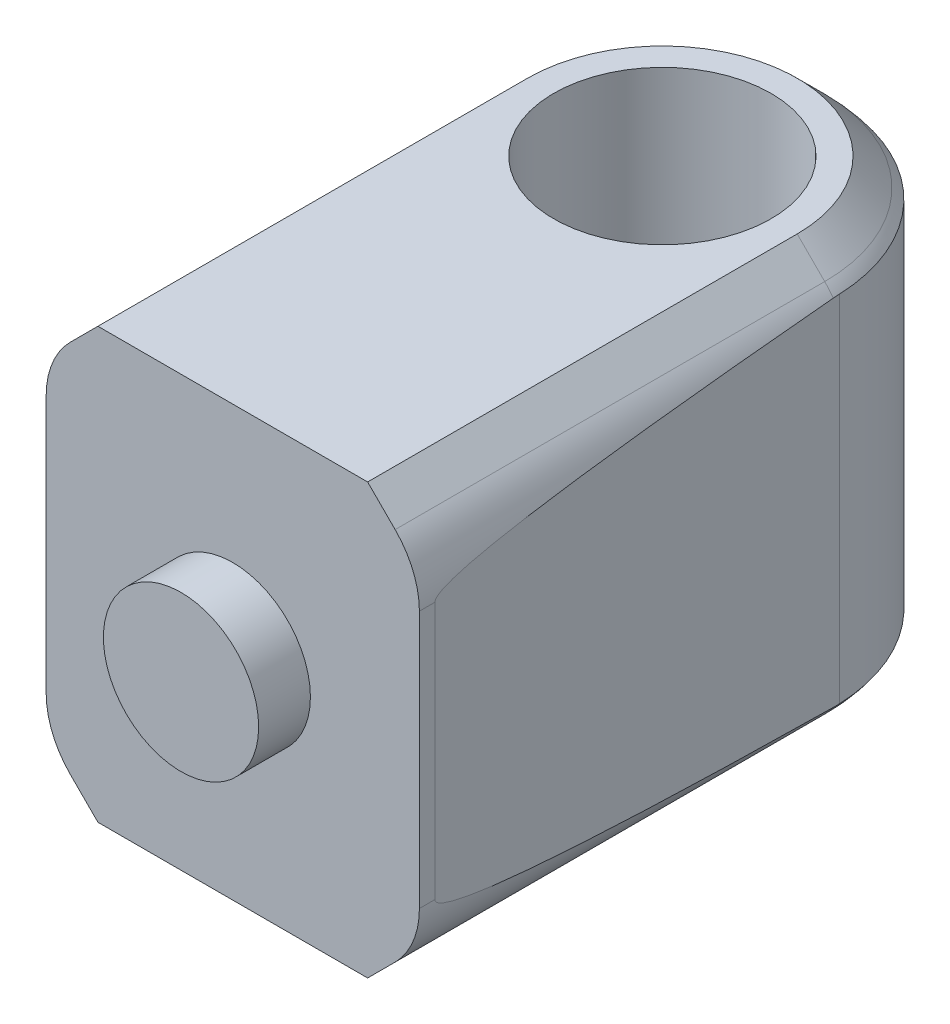
ISO-10303-21;
HEADER;
FILE_DESCRIPTION(('STEP AP214'),'2;1');
FILE_NAME('part.step','',(''),(''),'','','');
FILE_SCHEMA(('AUTOMOTIVE_DESIGN { 1 0 10303 214 1 1 1 1 }'));
ENDSEC;
DATA;
#1=APPLICATION_CONTEXT('core data for automotive mechanical design processes');
#2=APPLICATION_PROTOCOL_DEFINITION('international standard','automotive_design',2000,#1);
#3=PRODUCT_CONTEXT('',#1,'mechanical');
#4=PRODUCT('Part','Part','',(#3));
#5=PRODUCT_RELATED_PRODUCT_CATEGORY('part','',(#4));
#6=PRODUCT_DEFINITION_FORMATION('','',#4);
#7=PRODUCT_DEFINITION_CONTEXT('part definition',#1,'design');
#8=PRODUCT_DEFINITION('design','',#6,#7);
#9=PRODUCT_DEFINITION_SHAPE('','',#8);
#10=(LENGTH_UNIT() NAMED_UNIT(*) SI_UNIT(.MILLI.,.METRE.));
#11=(NAMED_UNIT(*) PLANE_ANGLE_UNIT() SI_UNIT($,.RADIAN.));
#12=(NAMED_UNIT(*) SI_UNIT($,.STERADIAN.) SOLID_ANGLE_UNIT());
#13=UNCERTAINTY_MEASURE_WITH_UNIT(LENGTH_MEASURE(1.E-05),#10,'distance_accuracy_value','');
#14=(GEOMETRIC_REPRESENTATION_CONTEXT(3) GLOBAL_UNCERTAINTY_ASSIGNED_CONTEXT((#13)) GLOBAL_UNIT_ASSIGNED_CONTEXT((#10,
#11,#12)) REPRESENTATION_CONTEXT('',''));
#15=CARTESIAN_POINT('',(0.,0.,0.));
#16=DIRECTION('',(0.,0.,1.));
#17=DIRECTION('',(1.,0.,0.));
#18=AXIS2_PLACEMENT_3D('',#15,#16,#17);
#19=CARTESIAN_POINT('',(0.,-15.6,34.));
#20=DIRECTION('',(0.,0.,1.));
#21=DIRECTION('',(1.,0.,0.));
#22=AXIS2_PLACEMENT_3D('',#19,#20,#21);
#23=PLANE('',#22);
#24=CARTESIAN_POINT('',(0.,-15.6,34.));
#25=DIRECTION('',(0.,0.,1.));
#26=DIRECTION('',(1.,0.,0.));
#27=AXIS2_PLACEMENT_3D('',#24,#25,#26);
#28=CIRCLE('',#27,7.5);
#29=CARTESIAN_POINT('',(7.5,-15.6,34.));
#30=VERTEX_POINT('',#29);
#31=EDGE_CURVE('E136',#30,#30,#28,.F.);
#32=ORIENTED_EDGE('',*,*,#31,.F.);
#33=EDGE_LOOP('',(#32));
#34=FACE_BOUND('',#33,.T.);
#35=ADVANCED_FACE('F16',(#34),#23,.T.);
#36=CARTESIAN_POINT('',(-18.0275,-36.35,27.5));
#37=DIRECTION('',(0.999282889986121,0.,0.0378643074806198));
#38=DIRECTION('',(0.0378643074806198,0.,-0.999282889986121));
#39=AXIS2_PLACEMENT_3D('',#36,#37,#38);
#40=PLANE('',#39);
#41=CARTESIAN_POINT('',(-16.488167684771,1.5380724136057,-13.1247610734302));
#42=CARTESIAN_POINT('',(-16.4921159039639,1.53807523926735,-13.0205630001558));
#43=CARTESIAN_POINT('',(-16.4960627736952,1.53671469873845,-12.9164005407328));
#44=CARTESIAN_POINT('',(-16.5039538142348,1.53126688529956,-12.7081468495894));
#45=CARTESIAN_POINT('',(-16.5078979850431,1.52717961238957,-12.604055617869));
#46=CARTESIAN_POINT('',(-16.5118408063899,1.52172897328904,-12.5));
#47=B_SPLINE_CURVE_WITH_KNOTS('',3,(#41,#42,#43,#44,#45,#46),.UNSPECIFIED.,.F.,.F.,(4,2,4),(0.,
0.312738263150495,0.62547652630099),.UNSPECIFIED.);
#48=CARTESIAN_POINT('',(-16.488167684771,1.5380724136057,-13.1247610734302));
#49=VERTEX_POINT('',#48);
#50=CARTESIAN_POINT('',(-16.5118408063898,1.52172897328904,-12.5));
#51=VERTEX_POINT('',#50);
#52=EDGE_CURVE('E19',#49,#51,#47,.T.);
#53=ORIENTED_EDGE('',*,*,#52,.F.);
#54=DIRECTION('',(0.,1.,0.));
#55=VECTOR('',#54,1.);
#56=CARTESIAN_POINT('',(-16.488167684771,-36.35,-13.1247610734302));
#57=LINE('',#56,#55);
#58=CARTESIAN_POINT('',(-16.488167684771,-32.7380724136057,-13.1247610734302));
#59=VERTEX_POINT('',#58);
#60=EDGE_CURVE('E127',#59,#49,#57,.T.);
#61=ORIENTED_EDGE('',*,*,#60,.F.);
#62=CARTESIAN_POINT('',(-16.5118408063899,-32.721728973289,-12.5));
#63=CARTESIAN_POINT('',(-16.5078979850431,-32.7271796123895,-12.604055617869));
#64=CARTESIAN_POINT('',(-16.5039538142348,-32.7312668852995,-12.7081468495894));
#65=CARTESIAN_POINT('',(-16.4960627736952,-32.7367146987384,-12.9164005407328));
#66=CARTESIAN_POINT('',(-16.4921159039639,-32.7380752392673,-13.0205630001558));
#67=CARTESIAN_POINT('',(-16.488167684771,-32.7380724136057,-13.1247610734302));
#68=B_SPLINE_CURVE_WITH_KNOTS('',3,(#62,#63,#64,#65,#66,#67),.UNSPECIFIED.,.F.,.F.,(4,2,4),(0.,
0.312738263150497,0.625476526300994),.UNSPECIFIED.);
#69=CARTESIAN_POINT('',(-16.5118408063898,-32.721728973289,-12.5));
#70=VERTEX_POINT('',#69);
#71=EDGE_CURVE('E211',#70,#59,#68,.T.);
#72=ORIENTED_EDGE('',*,*,#71,.F.);
#73=CARTESIAN_POINT('',(-10.0275,-28.0362915010152,-183.629257387863));
#74=DIRECTION('',(0.999282889986121,0.,0.0378643074806198));
#75=DIRECTION('',(0.0378643074806198,0.,-0.999282889986121));
#76=AXIS2_PLACEMENT_3D('',#73,#74,#75);
#77=ELLIPSE('',#76,211.280768943012,8.);
#78=CARTESIAN_POINT('',(-18.0275,-28.0362915010152,27.5));
#79=VERTEX_POINT('',#78);
#80=EDGE_CURVE('E165',#79,#70,#77,.T.);
#81=ORIENTED_EDGE('',*,*,#80,.F.);
#82=DIRECTION('',(0.,-1.,0.));
#83=VECTOR('',#82,1.);
#84=CARTESIAN_POINT('',(-18.0275,-3.16370849898476,27.5));
#85=LINE('',#84,#83);
#86=CARTESIAN_POINT('',(-18.0275,-3.16370849898476,27.5));
#87=VERTEX_POINT('',#86);
#88=EDGE_CURVE('E132',#87,#79,#85,.T.);
#89=ORIENTED_EDGE('',*,*,#88,.F.);
#90=CARTESIAN_POINT('',(-10.0275,-3.16370849898476,-183.629257387863));
#91=DIRECTION('',(0.999282889986121,0.,0.0378643074806198));
#92=DIRECTION('',(-0.0378643074806198,0.,0.999282889986121));
#93=AXIS2_PLACEMENT_3D('',#90,#91,#92);
#94=ELLIPSE('',#93,211.280768943012,8.);
#95=EDGE_CURVE('E129',#51,#87,#94,.T.);
#96=ORIENTED_EDGE('',*,*,#95,.F.);
#97=EDGE_LOOP('',(#53,#61,#72,#81,#89,#96));
#98=FACE_BOUND('',#97,.T.);
#99=ADVANCED_FACE('F130',(#98),#40,.F.);
#100=CARTESIAN_POINT('',(0.,-36.35,-12.5));
#101=DIRECTION('',(0.,1.,0.));
#102=DIRECTION('',(0.,0.,1.));
#103=AXIS2_PLACEMENT_3D('',#100,#101,#102);
#104=CYLINDRICAL_SURFACE('',#103,16.5);
#105=CARTESIAN_POINT('',(0.,-32.7380724136057,-12.5));
#106=DIRECTION('',(0.,-1.,0.));
#107=DIRECTION('',(0.,0.,-1.));
#108=AXIS2_PLACEMENT_3D('',#105,#106,#107);
#109=CIRCLE('',#108,16.5);
#110=CARTESIAN_POINT('',(16.488167684771,-32.7380724136057,-13.1247610734302));
#111=VERTEX_POINT('',#110);
#112=EDGE_CURVE('E190',#59,#111,#109,.T.);
#113=ORIENTED_EDGE('',*,*,#112,.F.);
#114=ORIENTED_EDGE('',*,*,#60,.T.);
#115=CARTESIAN_POINT('',(0.,1.5380724136057,-12.5));
#116=DIRECTION('',(0.,1.,0.));
#117=DIRECTION('',(0.,0.,1.));
#118=AXIS2_PLACEMENT_3D('',#115,#116,#117);
#119=CIRCLE('',#118,16.5);
#120=CARTESIAN_POINT('',(16.488167684771,1.53807241360571,-13.1247610734302));
#121=VERTEX_POINT('',#120);
#122=EDGE_CURVE('E126',#121,#49,#119,.T.);
#123=ORIENTED_EDGE('',*,*,#122,.F.);
#124=DIRECTION('',(0.,1.,0.));
#125=VECTOR('',#124,1.);
#126=CARTESIAN_POINT('',(16.488167684771,-36.35,-13.1247610734302));
#127=LINE('',#126,#125);
#128=EDGE_CURVE('E215',#121,#111,#127,.F.);
#129=ORIENTED_EDGE('',*,*,#128,.T.);
#130=EDGE_LOOP('',(#113,#114,#123,#129));
#131=FACE_BOUND('',#130,.T.);
#132=ADVANCED_FACE('F218',(#131),#104,.T.);
#133=CARTESIAN_POINT('',(16.488167684771,-36.35,-13.1247610734302));
#134=DIRECTION('',(-0.999282889986121,0.,0.0378643074806198));
#135=DIRECTION('',(0.0378643074806198,0.,0.999282889986121));
#136=AXIS2_PLACEMENT_3D('',#133,#134,#135);
#137=PLANE('',#136);
#138=CARTESIAN_POINT('',(10.0275,-3.16370849898476,-183.629257387863));
#139=DIRECTION('',(-0.999282889986121,0.,0.0378643074806198));
#140=DIRECTION('',(-0.0378643074806198,0.,-0.999282889986121));
#141=AXIS2_PLACEMENT_3D('',#138,#139,#140);
#142=ELLIPSE('',#141,211.280768943012,8.);
#143=CARTESIAN_POINT('',(18.0275,-3.16370849898476,27.4999999999998));
#144=VERTEX_POINT('',#143);
#145=CARTESIAN_POINT('',(16.5118408063898,1.52172897328904,-12.5));
#146=VERTEX_POINT('',#145);
#147=EDGE_CURVE('E292',#144,#146,#142,.T.);
#148=ORIENTED_EDGE('',*,*,#147,.F.);
#149=DIRECTION('',(0.,1.,0.));
#150=VECTOR('',#149,1.);
#151=CARTESIAN_POINT('',(18.0275,-28.0362915010152,27.5));
#152=LINE('',#151,#150);
#153=CARTESIAN_POINT('',(18.0275,-28.0362915010152,27.4999999999998));
#154=VERTEX_POINT('',#153);
#155=EDGE_CURVE('E171',#154,#144,#152,.T.);
#156=ORIENTED_EDGE('',*,*,#155,.F.);
#157=CARTESIAN_POINT('',(10.0275,-28.0362915010152,-183.629257387863));
#158=DIRECTION('',(-0.999282889986121,0.,0.0378643074806198));
#159=DIRECTION('',(0.0378643074806198,0.,0.999282889986121));
#160=AXIS2_PLACEMENT_3D('',#157,#158,#159);
#161=ELLIPSE('',#160,211.280768943012,8.);
#162=CARTESIAN_POINT('',(16.5118408063899,-32.721728973289,-12.5));
#163=VERTEX_POINT('',#162);
#164=EDGE_CURVE('E175',#163,#154,#161,.T.);
#165=ORIENTED_EDGE('',*,*,#164,.F.);
#166=CARTESIAN_POINT('',(16.488167684771,-32.7380724136057,-13.1247610734302));
#167=CARTESIAN_POINT('',(16.4921159039639,-32.7380752392673,-13.0205630001558));
#168=CARTESIAN_POINT('',(16.4960627736952,-32.7367146987384,-12.9164005407328));
#169=CARTESIAN_POINT('',(16.5039538142348,-32.7312668852995,-12.7081468495894));
#170=CARTESIAN_POINT('',(16.5078979850431,-32.7271796123895,-12.604055617869));
#171=CARTESIAN_POINT('',(16.5118408063899,-32.721728973289,-12.5));
#172=B_SPLINE_CURVE_WITH_KNOTS('',3,(#166,#167,#168,#169,#170,#171),.UNSPECIFIED.,.F.,.F.,(4,2,
4),(0.,0.312738263150492,0.625476526300984),.UNSPECIFIED.);
#173=EDGE_CURVE('E206',#111,#163,#172,.T.);
#174=ORIENTED_EDGE('',*,*,#173,.F.);
#175=ORIENTED_EDGE('',*,*,#128,.F.);
#176=CARTESIAN_POINT('',(16.5118408063899,1.52172897328903,-12.5));
#177=CARTESIAN_POINT('',(16.5078979850431,1.52717961238956,-12.604055617869));
#178=CARTESIAN_POINT('',(16.5039538142348,1.53126688529954,-12.7081468495894));
#179=CARTESIAN_POINT('',(16.4960627736952,1.53671469873843,-12.9164005407328));
#180=CARTESIAN_POINT('',(16.4921159039639,1.53807523926733,-13.0205630001558));
#181=CARTESIAN_POINT('',(16.488167684771,1.53807241360569,-13.1247610734302));
#182=B_SPLINE_CURVE_WITH_KNOTS('',3,(#176,#177,#178,#179,#180,#181),.UNSPECIFIED.,.F.,.F.,(4,2,
4),(0.,0.312738263150491,0.625476526300983),.UNSPECIFIED.);
#183=EDGE_CURVE('E143',#146,#121,#182,.T.);
#184=ORIENTED_EDGE('',*,*,#183,.F.);
#185=EDGE_LOOP('',(#148,#156,#165,#174,#175,#184));
#186=FACE_BOUND('',#185,.T.);
#187=ADVANCED_FACE('F199',(#186),#137,.F.);
#188=CARTESIAN_POINT('',(0.,-28.0362915010152,-12.5));
#189=DIRECTION('',(0.,-1.,0.));
#190=DIRECTION('',(0.,0.,-1.));
#191=AXIS2_PLACEMENT_3D('',#188,#189,#190);
#192=TOROIDAL_SURFACE('',#191,10.0275,8.);
#193=CARTESIAN_POINT('',(0.,-33.6931457505076,-12.5));
#194=DIRECTION('',(0.,1.,0.));
#195=DIRECTION('',(-1.,0.,0.));
#196=AXIS2_PLACEMENT_3D('',#193,#194,#195);
#197=CIRCLE('',#196,15.6843542494924);
#198=CARTESIAN_POINT('',(-15.6843542494924,-33.6931457505076,-12.5));
#199=VERTEX_POINT('',#198);
#200=CARTESIAN_POINT('',(15.6843542494924,-33.6931457505076,-12.5));
#201=VERTEX_POINT('',#200);
#202=EDGE_CURVE('E156',#199,#201,#197,.F.);
#203=ORIENTED_EDGE('',*,*,#202,.F.);
#204=CARTESIAN_POINT('',(-10.0275,-28.0362915010152,-12.5));
#205=DIRECTION('',(0.,0.,-1.));
#206=DIRECTION('',(-1.,0.,0.));
#207=AXIS2_PLACEMENT_3D('',#204,#205,#206);
#208=CIRCLE('',#207,8.);
#209=EDGE_CURVE('E162',#70,#199,#208,.F.);
#210=ORIENTED_EDGE('',*,*,#209,.F.);
#211=ORIENTED_EDGE('',*,*,#71,.T.);
#212=ORIENTED_EDGE('',*,*,#112,.T.);
#213=ORIENTED_EDGE('',*,*,#173,.T.);
#214=CARTESIAN_POINT('',(10.0275,-28.0362915010152,-12.5));
#215=DIRECTION('',(0.,0.,1.));
#216=DIRECTION('',(1.,0.,0.));
#217=AXIS2_PLACEMENT_3D('',#214,#215,#216);
#218=CIRCLE('',#217,8.);
#219=EDGE_CURVE('E172',#201,#163,#218,.T.);
#220=ORIENTED_EDGE('',*,*,#219,.F.);
#221=EDGE_LOOP('',(#203,#210,#211,#212,#213,#220));
#222=FACE_BOUND('',#221,.T.);
#223=ADVANCED_FACE('F193',(#222),#192,.T.);
#224=CARTESIAN_POINT('',(10.0275,-28.0362915010152,20.25));
#225=DIRECTION('',(0.,0.,1.));
#226=DIRECTION('',(1.,0.,0.));
#227=AXIS2_PLACEMENT_3D('',#224,#225,#226);
#228=CYLINDRICAL_SURFACE('',#227,8.);
#229=DIRECTION('',(0.,0.,1.));
#230=VECTOR('',#229,1.);
#231=CARTESIAN_POINT('',(15.6843542494924,-33.6931457505076,13.));
#232=LINE('',#231,#230);
#233=CARTESIAN_POINT('',(15.6843542494924,-33.6931457505076,29.));
#234=VERTEX_POINT('',#233);
#235=EDGE_CURVE('E178',#201,#234,#232,.T.);
#236=ORIENTED_EDGE('',*,*,#235,.F.);
#237=ORIENTED_EDGE('',*,*,#219,.T.);
#238=ORIENTED_EDGE('',*,*,#164,.T.);
#239=DIRECTION('',(0.,0.,-1.));
#240=VECTOR('',#239,1.);
#241=CARTESIAN_POINT('',(18.0275,-28.0362915010152,27.5));
#242=LINE('',#241,#240);
#243=CARTESIAN_POINT('',(18.0275,-28.0362915010152,29.));
#244=VERTEX_POINT('',#243);
#245=EDGE_CURVE('E168',#244,#154,#242,.T.);
#246=ORIENTED_EDGE('',*,*,#245,.F.);
#247=CARTESIAN_POINT('',(10.0275,-28.0362915010152,29.));
#248=DIRECTION('',(0.,0.,1.));
#249=DIRECTION('',(1.,0.,0.));
#250=AXIS2_PLACEMENT_3D('',#247,#248,#249);
#251=CIRCLE('',#250,8.);
#252=EDGE_CURVE('E323',#234,#244,#251,.T.);
#253=ORIENTED_EDGE('',*,*,#252,.F.);
#254=EDGE_LOOP('',(#236,#237,#238,#246,#253));
#255=FACE_BOUND('',#254,.T.);
#256=ADVANCED_FACE('F198',(#255),#228,.T.);
#257=CARTESIAN_POINT('',(18.0275,-28.0362915010152,27.5));
#258=DIRECTION('',(1.,0.,0.));
#259=DIRECTION('',(0.,0.,-1.));
#260=AXIS2_PLACEMENT_3D('',#257,#258,#259);
#261=PLANE('',#260);
#262=DIRECTION('',(0.,1.,0.));
#263=VECTOR('',#262,1.);
#264=CARTESIAN_POINT('',(18.0275,-15.6,29.));
#265=LINE('',#264,#263);
#266=CARTESIAN_POINT('',(18.0275,-3.16370849898476,29.));
#267=VERTEX_POINT('',#266);
#268=EDGE_CURVE('E324',#244,#267,#265,.T.);
#269=ORIENTED_EDGE('',*,*,#268,.F.);
#270=ORIENTED_EDGE('',*,*,#245,.T.);
#271=ORIENTED_EDGE('',*,*,#155,.T.);
#272=DIRECTION('',(0.,0.,-1.));
#273=VECTOR('',#272,1.);
#274=CARTESIAN_POINT('',(18.0275,-3.16370849898476,20.25));
#275=LINE('',#274,#273);
#276=EDGE_CURVE('E185',#267,#144,#275,.T.);
#277=ORIENTED_EDGE('',*,*,#276,.F.);
#278=EDGE_LOOP('',(#269,#270,#271,#277));
#279=FACE_BOUND('',#278,.T.);
#280=ADVANCED_FACE('F437',(#279),#261,.T.);
#281=CARTESIAN_POINT('',(-18.0275,-3.16370849898476,27.5));
#282=DIRECTION('',(-1.,0.,0.));
#283=DIRECTION('',(0.,-1.,0.));
#284=AXIS2_PLACEMENT_3D('',#281,#282,#283);
#285=PLANE('',#284);
#286=DIRECTION('',(0.,1.,0.));
#287=VECTOR('',#286,1.);
#288=CARTESIAN_POINT('',(-18.0275,-15.6,29.));
#289=LINE('',#288,#287);
#290=CARTESIAN_POINT('',(-18.0275,-3.16370849898476,29.));
#291=VERTEX_POINT('',#290);
#292=CARTESIAN_POINT('',(-18.0275,-28.0362915010152,29.));
#293=VERTEX_POINT('',#292);
#294=EDGE_CURVE('E327',#291,#293,#289,.F.);
#295=ORIENTED_EDGE('',*,*,#294,.F.);
#296=DIRECTION('',(0.,0.,1.));
#297=VECTOR('',#296,1.);
#298=CARTESIAN_POINT('',(-18.0275,-3.16370849898476,20.25));
#299=LINE('',#298,#297);
#300=EDGE_CURVE('E135',#87,#291,#299,.T.);
#301=ORIENTED_EDGE('',*,*,#300,.F.);
#302=ORIENTED_EDGE('',*,*,#88,.T.);
#303=DIRECTION('',(0.,0.,-1.));
#304=VECTOR('',#303,1.);
#305=CARTESIAN_POINT('',(-18.0275,-28.0362915010152,20.25));
#306=LINE('',#305,#304);
#307=EDGE_CURVE('E159',#293,#79,#306,.T.);
#308=ORIENTED_EDGE('',*,*,#307,.F.);
#309=EDGE_LOOP('',(#295,#301,#302,#308));
#310=FACE_BOUND('',#309,.T.);
#311=ADVANCED_FACE('F416',(#310),#285,.T.);
#312=CARTESIAN_POINT('',(-10.0275,-28.0362915010152,20.25));
#313=DIRECTION('',(0.,0.,-1.));
#314=DIRECTION('',(-1.,0.,0.));
#315=AXIS2_PLACEMENT_3D('',#312,#313,#314);
#316=CYLINDRICAL_SURFACE('',#315,8.);
#317=CARTESIAN_POINT('',(-10.0275,-28.0362915010152,29.));
#318=DIRECTION('',(0.,0.,-1.));
#319=DIRECTION('',(-1.,0.,0.));
#320=AXIS2_PLACEMENT_3D('',#317,#318,#319);
#321=CIRCLE('',#320,8.);
#322=CARTESIAN_POINT('',(-15.6843542494924,-33.6931457505076,29.));
#323=VERTEX_POINT('',#322);
#324=EDGE_CURVE('E329',#293,#323,#321,.F.);
#325=ORIENTED_EDGE('',*,*,#324,.F.);
#326=ORIENTED_EDGE('',*,*,#307,.T.);
#327=ORIENTED_EDGE('',*,*,#80,.T.);
#328=ORIENTED_EDGE('',*,*,#209,.T.);
#329=DIRECTION('',(0.,0.,1.));
#330=VECTOR('',#329,1.);
#331=CARTESIAN_POINT('',(-15.6843542494924,-33.6931457505076,13.));
#332=LINE('',#331,#330);
#333=EDGE_CURVE('E152',#323,#199,#332,.F.);
#334=ORIENTED_EDGE('',*,*,#333,.F.);
#335=EDGE_LOOP('',(#325,#326,#327,#328,#334));
#336=FACE_BOUND('',#335,.T.);
#337=ADVANCED_FACE('F419',(#336),#316,.T.);
#338=CARTESIAN_POINT('',(0.,-15.6,29.));
#339=DIRECTION('',(0.,0.,1.));
#340=DIRECTION('',(1.,0.,0.));
#341=AXIS2_PLACEMENT_3D('',#338,#339,#340);
#342=CYLINDRICAL_SURFACE('',#341,7.5);
#343=CARTESIAN_POINT('',(0.,-15.6,29.));
#344=DIRECTION('',(0.,0.,1.));
#345=DIRECTION('',(1.,0.,0.));
#346=AXIS2_PLACEMENT_3D('',#343,#344,#345);
#347=CIRCLE('',#346,7.5);
#348=CARTESIAN_POINT('',(7.5,-15.6,29.));
#349=VERTEX_POINT('',#348);
#350=EDGE_CURVE('E286',#349,#349,#347,.F.);
#351=ORIENTED_EDGE('',*,*,#350,.F.);
#352=EDGE_LOOP('',(#351));
#353=FACE_BOUND('',#352,.T.);
#354=ORIENTED_EDGE('',*,*,#31,.T.);
#355=EDGE_LOOP('',(#354));
#356=FACE_BOUND('',#355,.T.);
#357=ADVANCED_FACE('F458',(#353,#356),#342,.T.);
#358=CARTESIAN_POINT('',(-10.0275,-3.16370849898476,20.25));
#359=DIRECTION('',(0.,0.,1.));
#360=DIRECTION('',(1.,0.,0.));
#361=AXIS2_PLACEMENT_3D('',#358,#359,#360);
#362=CYLINDRICAL_SURFACE('',#361,8.);
#363=DIRECTION('',(0.,0.,1.));
#364=VECTOR('',#363,1.);
#365=CARTESIAN_POINT('',(-15.6843542494924,2.49314575050761,13.));
#366=LINE('',#365,#364);
#367=CARTESIAN_POINT('',(-15.6843542494924,2.49314575050761,-12.5));
#368=VERTEX_POINT('',#367);
#369=CARTESIAN_POINT('',(-15.6843542494924,2.49314575050762,29.));
#370=VERTEX_POINT('',#369);
#371=EDGE_CURVE('E141',#368,#370,#366,.T.);
#372=ORIENTED_EDGE('',*,*,#371,.F.);
#373=CARTESIAN_POINT('',(-10.0275,-3.16370849898476,-12.5));
#374=DIRECTION('',(0.,0.,1.));
#375=DIRECTION('',(-1.,0.,0.));
#376=AXIS2_PLACEMENT_3D('',#373,#374,#375);
#377=CIRCLE('',#376,8.);
#378=EDGE_CURVE('E123',#51,#368,#377,.F.);
#379=ORIENTED_EDGE('',*,*,#378,.F.);
#380=ORIENTED_EDGE('',*,*,#95,.T.);
#381=ORIENTED_EDGE('',*,*,#300,.T.);
#382=CARTESIAN_POINT('',(-10.0275,-3.16370849898476,29.));
#383=DIRECTION('',(0.,0.,1.));
#384=DIRECTION('',(1.,0.,0.));
#385=AXIS2_PLACEMENT_3D('',#382,#383,#384);
#386=CIRCLE('',#385,8.);
#387=EDGE_CURVE('E330',#370,#291,#386,.T.);
#388=ORIENTED_EDGE('',*,*,#387,.F.);
#389=EDGE_LOOP('',(#372,#379,#380,#381,#388));
#390=FACE_BOUND('',#389,.T.);
#391=ADVANCED_FACE('F139',(#390),#362,.T.);
#392=CARTESIAN_POINT('',(0.,-3.16370849898476,-12.5));
#393=DIRECTION('',(0.,1.,0.));
#394=DIRECTION('',(0.,0.,1.));
#395=AXIS2_PLACEMENT_3D('',#392,#393,#394);
#396=TOROIDAL_SURFACE('',#395,10.0275,8.);
#397=ORIENTED_EDGE('',*,*,#183,.T.);
#398=ORIENTED_EDGE('',*,*,#122,.T.);
#399=ORIENTED_EDGE('',*,*,#52,.T.);
#400=ORIENTED_EDGE('',*,*,#378,.T.);
#401=CARTESIAN_POINT('',(0.,2.49314575050761,-12.5));
#402=DIRECTION('',(0.,-1.,0.));
#403=DIRECTION('',(-1.,0.,0.));
#404=AXIS2_PLACEMENT_3D('',#401,#402,#403);
#405=CIRCLE('',#404,15.6843542494924);
#406=CARTESIAN_POINT('',(15.6843542494924,2.49314575050761,-12.5));
#407=VERTEX_POINT('',#406);
#408=EDGE_CURVE('E297',#407,#368,#405,.F.);
#409=ORIENTED_EDGE('',*,*,#408,.F.);
#410=CARTESIAN_POINT('',(10.0275,-3.16370849898476,-12.5));
#411=DIRECTION('',(0.,0.,-1.));
#412=DIRECTION('',(-1.,0.,0.));
#413=AXIS2_PLACEMENT_3D('',#410,#411,#412);
#414=CIRCLE('',#413,8.);
#415=EDGE_CURVE('E289',#146,#407,#414,.F.);
#416=ORIENTED_EDGE('',*,*,#415,.F.);
#417=EDGE_LOOP('',(#397,#398,#399,#400,#409,#416));
#418=FACE_BOUND('',#417,.T.);
#419=ADVANCED_FACE('F120',(#418),#396,.T.);
#420=CARTESIAN_POINT('',(10.0275,-3.16370849898476,20.25));
#421=DIRECTION('',(0.,0.,-1.));
#422=DIRECTION('',(-1.,0.,0.));
#423=AXIS2_PLACEMENT_3D('',#420,#421,#422);
#424=CYLINDRICAL_SURFACE('',#423,8.);
#425=CARTESIAN_POINT('',(10.0275,-3.16370849898476,29.));
#426=DIRECTION('',(0.,0.,-1.));
#427=DIRECTION('',(-1.,0.,0.));
#428=AXIS2_PLACEMENT_3D('',#425,#426,#427);
#429=CIRCLE('',#428,8.);
#430=CARTESIAN_POINT('',(15.6843542494924,2.49314575050762,29.));
#431=VERTEX_POINT('',#430);
#432=EDGE_CURVE('E326',#267,#431,#429,.F.);
#433=ORIENTED_EDGE('',*,*,#432,.F.);
#434=ORIENTED_EDGE('',*,*,#276,.T.);
#435=ORIENTED_EDGE('',*,*,#147,.T.);
#436=ORIENTED_EDGE('',*,*,#415,.T.);
#437=DIRECTION('',(0.,0.,1.));
#438=VECTOR('',#437,1.);
#439=CARTESIAN_POINT('',(15.6843542494924,2.49314575050761,13.));
#440=LINE('',#439,#438);
#441=EDGE_CURVE('E302',#431,#407,#440,.F.);
#442=ORIENTED_EDGE('',*,*,#441,.F.);
#443=EDGE_LOOP('',(#433,#434,#435,#436,#442));
#444=FACE_BOUND('',#443,.T.);
#445=ADVANCED_FACE('F271',(#444),#424,.T.);
#446=CARTESIAN_POINT('',(0.,-33.6931457505076,-12.5));
#447=DIRECTION('',(0.,1.,0.));
#448=DIRECTION('',(0.,0.,1.));
#449=AXIS2_PLACEMENT_3D('',#446,#447,#448);
#450=CONICAL_SURFACE('',#449,15.6843542494924,0.785398163397448);
#451=CARTESIAN_POINT('',(0.,-36.35,-12.5));
#452=DIRECTION('',(0.,1.,0.));
#453=DIRECTION('',(0.,0.,1.));
#454=AXIS2_PLACEMENT_3D('',#451,#452,#453);
#455=CIRCLE('',#454,13.0275);
#456=CARTESIAN_POINT('',(13.0275,-36.35,-12.5));
#457=VERTEX_POINT('',#456);
#458=CARTESIAN_POINT('',(-13.0275,-36.35,-12.5));
#459=VERTEX_POINT('',#458);
#460=EDGE_CURVE('E354',#457,#459,#455,.T.);
#461=ORIENTED_EDGE('',*,*,#460,.T.);
#462=DIRECTION('',(0.707106781186548,-0.707106781186548,0.));
#463=VECTOR('',#462,1.);
#464=CARTESIAN_POINT('',(-15.5275,-33.85,-12.5));
#465=LINE('',#464,#463);
#466=EDGE_CURVE('E155',#199,#459,#465,.T.);
#467=ORIENTED_EDGE('',*,*,#466,.F.);
#468=ORIENTED_EDGE('',*,*,#202,.T.);
#469=DIRECTION('',(0.707106781186548,0.707106781186548,0.));
#470=VECTOR('',#469,1.);
#471=CARTESIAN_POINT('',(15.5275,-33.85,-12.5));
#472=LINE('',#471,#470);
#473=EDGE_CURVE('E180',#457,#201,#472,.T.);
#474=ORIENTED_EDGE('',*,*,#473,.F.);
#475=EDGE_LOOP('',(#461,#467,#468,#474));
#476=FACE_BOUND('',#475,.T.);
#477=ADVANCED_FACE('F267',(#476),#450,.T.);
#478=CARTESIAN_POINT('',(-15.5275,-33.85,13.));
#479=DIRECTION('',(-0.707106781186548,-0.707106781186548,0.));
#480=DIRECTION('',(0.707106781186548,-0.707106781186548,0.));
#481=AXIS2_PLACEMENT_3D('',#478,#479,#480);
#482=PLANE('',#481);
#483=DIRECTION('',(0.,0.,1.));
#484=VECTOR('',#483,1.);
#485=CARTESIAN_POINT('',(-13.0275,-36.35,-1.5));
#486=LINE('',#485,#484);
#487=CARTESIAN_POINT('',(-13.0275,-36.35,29.));
#488=VERTEX_POINT('',#487);
#489=EDGE_CURVE('E313',#459,#488,#486,.T.);
#490=ORIENTED_EDGE('',*,*,#489,.T.);
#491=DIRECTION('',(0.707106781186547,-0.707106781186548,0.));
#492=VECTOR('',#491,1.);
#493=CARTESIAN_POINT('',(-15.6843542494924,-33.6931457505076,29.));
#494=LINE('',#493,#492);
#495=EDGE_CURVE('E333',#323,#488,#494,.T.);
#496=ORIENTED_EDGE('',*,*,#495,.F.);
#497=ORIENTED_EDGE('',*,*,#333,.T.);
#498=ORIENTED_EDGE('',*,*,#466,.T.);
#499=EDGE_LOOP('',(#490,#496,#497,#498));
#500=FACE_BOUND('',#499,.T.);
#501=ADVANCED_FACE('F263',(#500),#482,.T.);
#502=CARTESIAN_POINT('',(15.5275,-33.85,13.));
#503=DIRECTION('',(0.707106781186548,-0.707106781186548,0.));
#504=DIRECTION('',(0.707106781186548,0.707106781186548,0.));
#505=AXIS2_PLACEMENT_3D('',#502,#503,#504);
#506=PLANE('',#505);
#507=DIRECTION('',(0.,0.,1.));
#508=VECTOR('',#507,1.);
#509=CARTESIAN_POINT('',(13.0275,-36.35,-1.5));
#510=LINE('',#509,#508);
#511=CARTESIAN_POINT('',(13.0275,-36.35,29.));
#512=VERTEX_POINT('',#511);
#513=EDGE_CURVE('E312',#512,#457,#510,.F.);
#514=ORIENTED_EDGE('',*,*,#513,.T.);
#515=ORIENTED_EDGE('',*,*,#473,.T.);
#516=ORIENTED_EDGE('',*,*,#235,.T.);
#517=DIRECTION('',(0.707106781186547,0.707106781186548,0.));
#518=VECTOR('',#517,1.);
#519=CARTESIAN_POINT('',(13.0275,-36.35,29.));
#520=LINE('',#519,#518);
#521=EDGE_CURVE('E318',#512,#234,#520,.T.);
#522=ORIENTED_EDGE('',*,*,#521,.F.);
#523=EDGE_LOOP('',(#514,#515,#516,#522));
#524=FACE_BOUND('',#523,.T.);
#525=ADVANCED_FACE('F259',(#524),#506,.T.);
#526=CARTESIAN_POINT('',(0.,-15.6,29.));
#527=DIRECTION('',(0.,0.,1.));
#528=DIRECTION('',(1.,0.,0.));
#529=AXIS2_PLACEMENT_3D('',#526,#527,#528);
#530=PLANE('',#529);
#531=ORIENTED_EDGE('',*,*,#350,.T.);
#532=EDGE_LOOP('',(#531));
#533=FACE_BOUND('',#532,.T.);
#534=ORIENTED_EDGE('',*,*,#495,.T.);
#535=DIRECTION('',(1.,0.,0.));
#536=VECTOR('',#535,1.);
#537=CARTESIAN_POINT('',(0.,-36.35,29.));
#538=LINE('',#537,#536);
#539=EDGE_CURVE('E309',#488,#512,#538,.T.);
#540=ORIENTED_EDGE('',*,*,#539,.T.);
#541=ORIENTED_EDGE('',*,*,#521,.T.);
#542=ORIENTED_EDGE('',*,*,#252,.T.);
#543=ORIENTED_EDGE('',*,*,#268,.T.);
#544=ORIENTED_EDGE('',*,*,#432,.T.);
#545=DIRECTION('',(-0.707106781186548,0.707106781186548,0.));
#546=VECTOR('',#545,1.);
#547=CARTESIAN_POINT('',(15.5275,2.65,29.));
#548=LINE('',#547,#546);
#549=CARTESIAN_POINT('',(13.0275,5.15,29.));
#550=VERTEX_POINT('',#549);
#551=EDGE_CURVE('E351',#550,#431,#548,.F.);
#552=ORIENTED_EDGE('',*,*,#551,.F.);
#553=DIRECTION('',(1.,0.,0.));
#554=VECTOR('',#553,1.);
#555=CARTESIAN_POINT('',(0.,5.15,29.));
#556=LINE('',#555,#554);
#557=CARTESIAN_POINT('',(-13.0275,5.15,29.));
#558=VERTEX_POINT('',#557);
#559=EDGE_CURVE('E345',#550,#558,#556,.F.);
#560=ORIENTED_EDGE('',*,*,#559,.T.);
#561=DIRECTION('',(-0.707106781186548,-0.707106781186547,0.));
#562=VECTOR('',#561,1.);
#563=CARTESIAN_POINT('',(-15.5275,2.65,29.));
#564=LINE('',#563,#562);
#565=EDGE_CURVE('E285',#370,#558,#564,.F.);
#566=ORIENTED_EDGE('',*,*,#565,.F.);
#567=ORIENTED_EDGE('',*,*,#387,.T.);
#568=ORIENTED_EDGE('',*,*,#294,.T.);
#569=ORIENTED_EDGE('',*,*,#324,.T.);
#570=EDGE_LOOP('',(#534,#540,#541,#542,#543,#544,#552,#560,#566,#567,#568,#569));
#571=FACE_BOUND('',#570,.T.);
#572=ADVANCED_FACE('F255',(#533,#571),#530,.T.);
#573=CARTESIAN_POINT('',(-15.5275,2.65,13.));
#574=DIRECTION('',(-0.707106781186547,0.707106781186548,0.));
#575=DIRECTION('',(-0.707106781186548,-0.707106781186547,0.));
#576=AXIS2_PLACEMENT_3D('',#573,#574,#575);
#577=PLANE('',#576);
#578=DIRECTION('',(0.,0.,-1.));
#579=VECTOR('',#578,1.);
#580=CARTESIAN_POINT('',(-13.0275,5.15,-1.5));
#581=LINE('',#580,#579);
#582=CARTESIAN_POINT('',(-13.0275,5.15,-12.5));
#583=VERTEX_POINT('',#582);
#584=EDGE_CURVE('E348',#558,#583,#581,.T.);
#585=ORIENTED_EDGE('',*,*,#584,.T.);
#586=DIRECTION('',(0.707106781186547,0.707106781186548,0.));
#587=VECTOR('',#586,1.);
#588=CARTESIAN_POINT('',(-15.5275,2.65,-12.5));
#589=LINE('',#588,#587);
#590=EDGE_CURVE('E299',#368,#583,#589,.T.);
#591=ORIENTED_EDGE('',*,*,#590,.F.);
#592=ORIENTED_EDGE('',*,*,#371,.T.);
#593=ORIENTED_EDGE('',*,*,#565,.T.);
#594=EDGE_LOOP('',(#585,#591,#592,#593));
#595=FACE_BOUND('',#594,.T.);
#596=ADVANCED_FACE('F251',(#595),#577,.T.);
#597=CARTESIAN_POINT('',(0.,2.49314575050761,-12.5));
#598=DIRECTION('',(0.,-1.,0.));
#599=DIRECTION('',(0.,0.,-1.));
#600=AXIS2_PLACEMENT_3D('',#597,#598,#599);
#601=CONICAL_SURFACE('',#600,15.6843542494924,0.785398163397448);
#602=CARTESIAN_POINT('',(0.,5.15,-12.5));
#603=DIRECTION('',(0.,-1.,0.));
#604=DIRECTION('',(0.,0.,-1.));
#605=AXIS2_PLACEMENT_3D('',#602,#603,#604);
#606=CIRCLE('',#605,13.0275);
#607=CARTESIAN_POINT('',(13.0275,5.15,-12.5));
#608=VERTEX_POINT('',#607);
#609=EDGE_CURVE('E370',#583,#608,#606,.T.);
#610=ORIENTED_EDGE('',*,*,#609,.T.);
#611=DIRECTION('',(-0.707106781186548,0.707106781186548,0.));
#612=VECTOR('',#611,1.);
#613=CARTESIAN_POINT('',(15.5275,2.65,-12.5));
#614=LINE('',#613,#612);
#615=EDGE_CURVE('E38',#407,#608,#614,.T.);
#616=ORIENTED_EDGE('',*,*,#615,.F.);
#617=ORIENTED_EDGE('',*,*,#408,.T.);
#618=ORIENTED_EDGE('',*,*,#590,.T.);
#619=EDGE_LOOP('',(#610,#616,#617,#618));
#620=FACE_BOUND('',#619,.T.);
#621=ADVANCED_FACE('F248',(#620),#601,.T.);
#622=CARTESIAN_POINT('',(15.5275,2.65,13.));
#623=DIRECTION('',(0.707106781186548,0.707106781186548,0.));
#624=DIRECTION('',(-0.707106781186548,0.707106781186548,0.));
#625=AXIS2_PLACEMENT_3D('',#622,#623,#624);
#626=PLANE('',#625);
#627=DIRECTION('',(0.,0.,-1.));
#628=VECTOR('',#627,1.);
#629=CARTESIAN_POINT('',(13.0275,5.15,-1.5));
#630=LINE('',#629,#628);
#631=EDGE_CURVE('E373',#608,#550,#630,.F.);
#632=ORIENTED_EDGE('',*,*,#631,.T.);
#633=ORIENTED_EDGE('',*,*,#551,.T.);
#634=ORIENTED_EDGE('',*,*,#441,.T.);
#635=ORIENTED_EDGE('',*,*,#615,.T.);
#636=EDGE_LOOP('',(#632,#633,#634,#635));
#637=FACE_BOUND('',#636,.T.);
#638=ADVANCED_FACE('F244',(#637),#626,.T.);
#639=CARTESIAN_POINT('',(0.,-36.35,-1.5));
#640=DIRECTION('',(0.,1.,0.));
#641=DIRECTION('',(0.,0.,1.));
#642=AXIS2_PLACEMENT_3D('',#639,#640,#641);
#643=PLANE('',#642);
#644=CARTESIAN_POINT('',(0.,-36.35,-12.5));
#645=DIRECTION('',(0.,-1.,0.));
#646=DIRECTION('',(0.,0.,-1.));
#647=AXIS2_PLACEMENT_3D('',#644,#645,#646);
#648=CIRCLE('',#647,10.5);
#649=CARTESIAN_POINT('',(0.,-36.35,-23.));
#650=VERTEX_POINT('',#649);
#651=EDGE_CURVE('E29',#650,#650,#648,.F.);
#652=ORIENTED_EDGE('',*,*,#651,.T.);
#653=EDGE_LOOP('',(#652));
#654=FACE_BOUND('',#653,.T.);
#655=ORIENTED_EDGE('',*,*,#539,.F.);
#656=ORIENTED_EDGE('',*,*,#489,.F.);
#657=ORIENTED_EDGE('',*,*,#460,.F.);
#658=ORIENTED_EDGE('',*,*,#513,.F.);
#659=EDGE_LOOP('',(#655,#656,#657,#658));
#660=FACE_BOUND('',#659,.T.);
#661=ADVANCED_FACE('F236',(#654,#660),#643,.F.);
#662=CARTESIAN_POINT('',(0.,5.15,-1.5));
#663=DIRECTION('',(0.,-1.,0.));
#664=DIRECTION('',(0.,0.,-1.));
#665=AXIS2_PLACEMENT_3D('',#662,#663,#664);
#666=PLANE('',#665);
#667=CARTESIAN_POINT('',(0.,5.15,-12.5));
#668=DIRECTION('',(0.,-1.,0.));
#669=DIRECTION('',(0.,0.,-1.));
#670=AXIS2_PLACEMENT_3D('',#667,#668,#669);
#671=CIRCLE('',#670,10.5);
#672=CARTESIAN_POINT('',(0.,5.15,-23.));
#673=VERTEX_POINT('',#672);
#674=EDGE_CURVE('E11',#673,#673,#671,.T.);
#675=ORIENTED_EDGE('',*,*,#674,.T.);
#676=EDGE_LOOP('',(#675));
#677=FACE_BOUND('',#676,.T.);
#678=ORIENTED_EDGE('',*,*,#609,.F.);
#679=ORIENTED_EDGE('',*,*,#584,.F.);
#680=ORIENTED_EDGE('',*,*,#559,.F.);
#681=ORIENTED_EDGE('',*,*,#631,.F.);
#682=EDGE_LOOP('',(#678,#679,#680,#681));
#683=FACE_BOUND('',#682,.T.);
#684=ADVANCED_FACE('F230',(#677,#683),#666,.F.);
#685=CARTESIAN_POINT('',(0.,6.95,-12.5));
#686=DIRECTION('',(0.,-1.,0.));
#687=DIRECTION('',(0.,0.,-1.));
#688=AXIS2_PLACEMENT_3D('',#685,#686,#687);
#689=CYLINDRICAL_SURFACE('',#688,10.5);
#690=ORIENTED_EDGE('',*,*,#674,.F.);
#691=EDGE_LOOP('',(#690));
#692=FACE_BOUND('',#691,.T.);
#693=ORIENTED_EDGE('',*,*,#651,.F.);
#694=EDGE_LOOP('',(#693));
#695=FACE_BOUND('',#694,.T.);
#696=ADVANCED_FACE('F228',(#692,#695),#689,.F.);
#697=CLOSED_SHELL('',(#35,#99,#132,#187,#223,#256,#280,#311,#337,#357,#391,#419,#445,#477,#501,
#525,#572,#596,#621,#638,#661,#684,#696));
#698=MANIFOLD_SOLID_BREP('B1',#697);
#699=ADVANCED_BREP_SHAPE_REPRESENTATION('',(#18,#698),#14);
#700=SHAPE_DEFINITION_REPRESENTATION(#9,#699);
ENDSEC;
END-ISO-10303-21;
